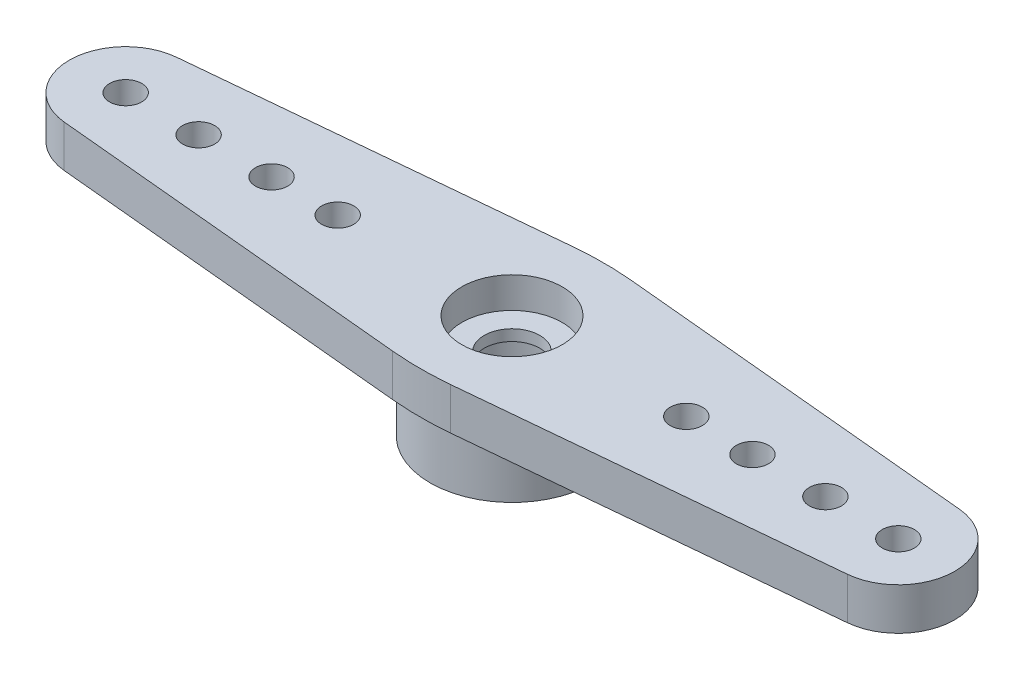
ISO-10303-21;
HEADER;
FILE_DESCRIPTION(('STEP AP214'),'2;1');
FILE_NAME('part.step','',(''),(''),'','','');
FILE_SCHEMA(('AUTOMOTIVE_DESIGN { 1 0 10303 214 1 1 1 1 }'));
ENDSEC;
DATA;
#1=APPLICATION_CONTEXT('core data for automotive mechanical design processes');
#2=APPLICATION_PROTOCOL_DEFINITION('international standard','automotive_design',2000,#1);
#3=PRODUCT_CONTEXT('',#1,'mechanical');
#4=PRODUCT('Part','Part','',(#3));
#5=PRODUCT_RELATED_PRODUCT_CATEGORY('part','',(#4));
#6=PRODUCT_DEFINITION_FORMATION('','',#4);
#7=PRODUCT_DEFINITION_CONTEXT('part definition',#1,'design');
#8=PRODUCT_DEFINITION('design','',#6,#7);
#9=PRODUCT_DEFINITION_SHAPE('','',#8);
#10=(LENGTH_UNIT() NAMED_UNIT(*) SI_UNIT(.MILLI.,.METRE.));
#11=(NAMED_UNIT(*) PLANE_ANGLE_UNIT() SI_UNIT($,.RADIAN.));
#12=(NAMED_UNIT(*) SI_UNIT($,.STERADIAN.) SOLID_ANGLE_UNIT());
#13=UNCERTAINTY_MEASURE_WITH_UNIT(LENGTH_MEASURE(1.E-05),#10,'distance_accuracy_value','');
#14=(GEOMETRIC_REPRESENTATION_CONTEXT(3) GLOBAL_UNCERTAINTY_ASSIGNED_CONTEXT((#13)) GLOBAL_UNIT_ASSIGNED_CONTEXT((#10,
#11,#12)) REPRESENTATION_CONTEXT('',''));
#15=CARTESIAN_POINT('',(0.,0.,0.));
#16=DIRECTION('',(0.,0.,1.));
#17=DIRECTION('',(1.,0.,0.));
#18=AXIS2_PLACEMENT_3D('',#15,#16,#17);
#19=CARTESIAN_POINT('',(0.,4.2672,0.));
#20=DIRECTION('',(0.,-1.,0.));
#21=DIRECTION('',(0.,0.,-1.));
#22=AXIS2_PLACEMENT_3D('',#19,#20,#21);
#23=CYLINDRICAL_SURFACE('',#22,1.143);
#24=CARTESIAN_POINT('',(0.,2.54,0.));
#25=DIRECTION('',(0.,1.,0.));
#26=DIRECTION('',(0.,0.,1.));
#27=AXIS2_PLACEMENT_3D('',#24,#25,#26);
#28=CIRCLE('',#27,1.143);
#29=CARTESIAN_POINT('',(0.,2.54,1.143));
#30=VERTEX_POINT('',#29);
#31=EDGE_CURVE('E196',#30,#30,#28,.T.);
#32=ORIENTED_EDGE('',*,*,#31,.F.);
#33=EDGE_LOOP('',(#32));
#34=FACE_BOUND('',#33,.T.);
#35=CARTESIAN_POINT('',(0.,2.9972,0.));
#36=DIRECTION('',(0.,1.,0.));
#37=DIRECTION('',(0.,0.,1.));
#38=AXIS2_PLACEMENT_3D('',#35,#36,#37);
#39=CIRCLE('',#38,1.143);
#40=CARTESIAN_POINT('',(0.,2.9972,1.143));
#41=VERTEX_POINT('',#40);
#42=EDGE_CURVE('E356',#41,#41,#39,.F.);
#43=ORIENTED_EDGE('',*,*,#42,.F.);
#44=EDGE_LOOP('',(#43));
#45=FACE_BOUND('',#44,.T.);
#46=ADVANCED_FACE('F34',(#34,#45),#23,.F.);
#47=CARTESIAN_POINT('',(0.,0.,0.));
#48=DIRECTION('',(0.,1.,0.));
#49=DIRECTION('',(0.,0.,1.));
#50=AXIS2_PLACEMENT_3D('',#47,#48,#49);
#51=PLANE('',#50);
#52=CARTESIAN_POINT('',(0.,0.,0.));
#53=DIRECTION('',(0.,1.,0.));
#54=DIRECTION('',(0.,0.,1.));
#55=AXIS2_PLACEMENT_3D('',#52,#53,#54);
#56=CIRCLE('',#55,3.3655);
#57=CARTESIAN_POINT('',(0.,0.,3.3655));
#58=VERTEX_POINT('',#57);
#59=EDGE_CURVE('E210',#58,#58,#56,.T.);
#60=ORIENTED_EDGE('',*,*,#59,.F.);
#61=EDGE_LOOP('',(#60));
#62=FACE_BOUND('',#61,.T.);
#63=CARTESIAN_POINT('',(0.,0.,0.));
#64=DIRECTION('',(0.,1.,0.));
#65=DIRECTION('',(0.,0.,1.));
#66=AXIS2_PLACEMENT_3D('',#63,#64,#65);
#67=CIRCLE('',#66,2.2352);
#68=CARTESIAN_POINT('',(0.,0.,2.2352));
#69=VERTEX_POINT('',#68);
#70=EDGE_CURVE('E207',#69,#69,#67,.T.);
#71=ORIENTED_EDGE('',*,*,#70,.T.);
#72=EDGE_LOOP('',(#71));
#73=FACE_BOUND('',#72,.T.);
#74=ADVANCED_FACE('F257',(#62,#73),#51,.F.);
#75=CARTESIAN_POINT('',(0.,2.54,0.));
#76=DIRECTION('',(0.,-1.,0.));
#77=DIRECTION('',(0.,0.,-1.));
#78=AXIS2_PLACEMENT_3D('',#75,#76,#77);
#79=CYLINDRICAL_SURFACE('',#78,3.3655);
#80=CARTESIAN_POINT('',(0.,2.54,0.));
#81=DIRECTION('',(0.,1.,0.));
#82=DIRECTION('',(0.,0.,1.));
#83=AXIS2_PLACEMENT_3D('',#80,#81,#82);
#84=CIRCLE('',#83,3.3655);
#85=CARTESIAN_POINT('',(0.,2.54,3.3655));
#86=VERTEX_POINT('',#85);
#87=EDGE_CURVE('E211',#86,#86,#84,.T.);
#88=ORIENTED_EDGE('',*,*,#87,.F.);
#89=EDGE_LOOP('',(#88));
#90=FACE_BOUND('',#89,.T.);
#91=ORIENTED_EDGE('',*,*,#59,.T.);
#92=EDGE_LOOP('',(#91));
#93=FACE_BOUND('',#92,.T.);
#94=ADVANCED_FACE('F263',(#90,#93),#79,.T.);
#95=CARTESIAN_POINT('',(0.,2.54,0.));
#96=DIRECTION('',(0.,-1.,0.));
#97=DIRECTION('',(0.,0.,-1.));
#98=AXIS2_PLACEMENT_3D('',#95,#96,#97);
#99=CYLINDRICAL_SURFACE('',#98,2.2352);
#100=CARTESIAN_POINT('',(0.,2.54,0.));
#101=DIRECTION('',(0.,1.,0.));
#102=DIRECTION('',(0.,0.,1.));
#103=AXIS2_PLACEMENT_3D('',#100,#101,#102);
#104=CIRCLE('',#103,2.2352);
#105=CARTESIAN_POINT('',(0.,2.54,2.2352));
#106=VERTEX_POINT('',#105);
#107=EDGE_CURVE('E119',#106,#106,#104,.T.);
#108=ORIENTED_EDGE('',*,*,#107,.T.);
#109=EDGE_LOOP('',(#108));
#110=FACE_BOUND('',#109,.T.);
#111=ORIENTED_EDGE('',*,*,#70,.F.);
#112=EDGE_LOOP('',(#111));
#113=FACE_BOUND('',#112,.T.);
#114=ADVANCED_FACE('F316',(#110,#113),#99,.F.);
#115=CARTESIAN_POINT('',(-29.0607200096115,2.54,0.));
#116=DIRECTION('',(0.,1.,0.));
#117=DIRECTION('',(0.,0.,1.));
#118=AXIS2_PLACEMENT_3D('',#115,#116,#117);
#119=PLANE('',#118);
#120=CARTESIAN_POINT('',(-9.8806,2.54,0.));
#121=DIRECTION('',(0.,1.,0.));
#122=DIRECTION('',(0.,0.,1.));
#123=AXIS2_PLACEMENT_3D('',#120,#121,#122);
#124=CIRCLE('',#123,0.6604);
#125=CARTESIAN_POINT('',(-9.8806,2.54,0.6604));
#126=VERTEX_POINT('',#125);
#127=EDGE_CURVE('E159',#126,#126,#124,.F.);
#128=ORIENTED_EDGE('',*,*,#127,.F.);
#129=EDGE_LOOP('',(#128));
#130=FACE_BOUND('',#129,.T.);
#131=DIRECTION('',(-0.995596740434201,0.,0.0937396950965555));
#132=VECTOR('',#131,1.);
#133=CARTESIAN_POINT('',(-29.162120546294,2.54,-1.07696151236052));
#134=LINE('',#133,#132);
#135=CARTESIAN_POINT('',(-1.19049412772623,2.54,-3.71060988156648));
#136=VERTEX_POINT('',#135);
#137=CARTESIAN_POINT('',(-16.09226517831,2.54,-2.30754434514137));
#138=VERTEX_POINT('',#137);
#139=EDGE_CURVE('E115',#136,#138,#134,.T.);
#140=ORIENTED_EDGE('',*,*,#139,.F.);
#141=CARTESIAN_POINT('',(0.,2.54,8.93346872194787));
#142=DIRECTION('',(0.,1.,0.));
#143=DIRECTION('',(0.,0.,1.));
#144=AXIS2_PLACEMENT_3D('',#141,#142,#143);
#145=CIRCLE('',#144,12.7);
#146=CARTESIAN_POINT('',(1.19049412772628,2.54,-3.71060988156648));
#147=VERTEX_POINT('',#146);
#148=EDGE_CURVE('E220',#136,#147,#145,.F.);
#149=ORIENTED_EDGE('',*,*,#148,.T.);
#150=DIRECTION('',(0.995596740434201,0.,0.0937396950965555));
#151=VECTOR('',#150,1.);
#152=CARTESIAN_POINT('',(-28.4485987983057,2.54,-6.50125736059801));
#153=LINE('',#152,#151);
#154=CARTESIAN_POINT('',(16.09226517831,2.54,-2.30754434514137));
#155=VERTEX_POINT('',#154);
#156=EDGE_CURVE('E173',#147,#155,#153,.T.);
#157=ORIENTED_EDGE('',*,*,#156,.T.);
#158=CARTESIAN_POINT('',(15.875,2.54,0.));
#159=DIRECTION('',(0.,1.,0.));
#160=DIRECTION('',(0.,0.,1.));
#161=AXIS2_PLACEMENT_3D('',#158,#159,#160);
#162=CIRCLE('',#161,2.31775);
#163=CARTESIAN_POINT('',(16.09226517831,2.54,2.30754434514137));
#164=VERTEX_POINT('',#163);
#165=EDGE_CURVE('E170',#164,#155,#162,.T.);
#166=ORIENTED_EDGE('',*,*,#165,.F.);
#167=DIRECTION('',(0.995596740434201,0.,-0.0937396950965555));
#168=VECTOR('',#167,1.);
#169=CARTESIAN_POINT('',(-28.4485987983057,2.54,6.50125736059801));
#170=LINE('',#169,#168);
#171=CARTESIAN_POINT('',(1.19049412772627,2.54,3.71060988156648));
#172=VERTEX_POINT('',#171);
#173=EDGE_CURVE('E168',#172,#164,#170,.T.);
#174=ORIENTED_EDGE('',*,*,#173,.F.);
#175=CARTESIAN_POINT('',(0.,2.54,-8.93346872194787));
#176=DIRECTION('',(0.,1.,0.));
#177=DIRECTION('',(0.,0.,1.));
#178=AXIS2_PLACEMENT_3D('',#175,#176,#177);
#179=CIRCLE('',#178,12.7);
#180=CARTESIAN_POINT('',(-1.19049412772624,2.54,3.71060988156648));
#181=VERTEX_POINT('',#180);
#182=EDGE_CURVE('E218',#172,#181,#179,.F.);
#183=ORIENTED_EDGE('',*,*,#182,.T.);
#184=DIRECTION('',(-0.995596740434201,0.,-0.0937396950965555));
#185=VECTOR('',#184,1.);
#186=CARTESIAN_POINT('',(-29.162120546294,2.54,1.07696151236052));
#187=LINE('',#186,#185);
#188=CARTESIAN_POINT('',(-16.09226517831,2.54,2.30754434514137));
#189=VERTEX_POINT('',#188);
#190=EDGE_CURVE('E166',#181,#189,#187,.T.);
#191=ORIENTED_EDGE('',*,*,#190,.T.);
#192=CARTESIAN_POINT('',(-15.875,2.54,0.));
#193=DIRECTION('',(0.,1.,0.));
#194=DIRECTION('',(0.,0.,1.));
#195=AXIS2_PLACEMENT_3D('',#192,#193,#194);
#196=CIRCLE('',#195,2.31775);
#197=EDGE_CURVE('E164',#189,#138,#196,.F.);
#198=ORIENTED_EDGE('',*,*,#197,.T.);
#199=EDGE_LOOP('',(#140,#149,#157,#166,#174,#183,#191,#198));
#200=FACE_BOUND('',#199,.T.);
#201=CARTESIAN_POINT('',(-7.1628,2.54,0.));
#202=DIRECTION('',(0.,1.,0.));
#203=DIRECTION('',(0.,0.,1.));
#204=AXIS2_PLACEMENT_3D('',#201,#202,#203);
#205=CIRCLE('',#204,0.6604);
#206=CARTESIAN_POINT('',(-7.1628,2.54,0.6604));
#207=VERTEX_POINT('',#206);
#208=EDGE_CURVE('E175',#207,#207,#205,.F.);
#209=ORIENTED_EDGE('',*,*,#208,.F.);
#210=EDGE_LOOP('',(#209));
#211=FACE_BOUND('',#210,.T.);
#212=CARTESIAN_POINT('',(-12.8778,2.54,0.));
#213=DIRECTION('',(0.,1.,0.));
#214=DIRECTION('',(0.,0.,1.));
#215=AXIS2_PLACEMENT_3D('',#212,#213,#214);
#216=CIRCLE('',#215,0.660399999999998);
#217=CARTESIAN_POINT('',(-12.8778,2.54,0.660399999999998));
#218=VERTEX_POINT('',#217);
#219=EDGE_CURVE('E178',#218,#218,#216,.F.);
#220=ORIENTED_EDGE('',*,*,#219,.F.);
#221=EDGE_LOOP('',(#220));
#222=FACE_BOUND('',#221,.T.);
#223=CARTESIAN_POINT('',(-15.875,2.54,0.));
#224=DIRECTION('',(0.,1.,0.));
#225=DIRECTION('',(0.,0.,1.));
#226=AXIS2_PLACEMENT_3D('',#223,#224,#225);
#227=CIRCLE('',#226,0.660399999999998);
#228=CARTESIAN_POINT('',(-15.875,2.54,0.660399999999998));
#229=VERTEX_POINT('',#228);
#230=EDGE_CURVE('E181',#229,#229,#227,.F.);
#231=ORIENTED_EDGE('',*,*,#230,.F.);
#232=EDGE_LOOP('',(#231));
#233=FACE_BOUND('',#232,.T.);
#234=CARTESIAN_POINT('',(12.8778,2.54,0.));
#235=DIRECTION('',(0.,1.,0.));
#236=DIRECTION('',(0.,0.,1.));
#237=AXIS2_PLACEMENT_3D('',#234,#235,#236);
#238=CIRCLE('',#237,0.660399999999998);
#239=CARTESIAN_POINT('',(12.8778,2.54,0.660399999999998));
#240=VERTEX_POINT('',#239);
#241=EDGE_CURVE('E184',#240,#240,#238,.T.);
#242=ORIENTED_EDGE('',*,*,#241,.T.);
#243=EDGE_LOOP('',(#242));
#244=FACE_BOUND('',#243,.T.);
#245=CARTESIAN_POINT('',(9.8806,2.54,0.));
#246=DIRECTION('',(0.,1.,0.));
#247=DIRECTION('',(0.,0.,1.));
#248=AXIS2_PLACEMENT_3D('',#245,#246,#247);
#249=CIRCLE('',#248,0.6604);
#250=CARTESIAN_POINT('',(9.8806,2.54,0.6604));
#251=VERTEX_POINT('',#250);
#252=EDGE_CURVE('E187',#251,#251,#249,.T.);
#253=ORIENTED_EDGE('',*,*,#252,.T.);
#254=EDGE_LOOP('',(#253));
#255=FACE_BOUND('',#254,.T.);
#256=CARTESIAN_POINT('',(7.1628,2.54,0.));
#257=DIRECTION('',(0.,1.,0.));
#258=DIRECTION('',(0.,0.,1.));
#259=AXIS2_PLACEMENT_3D('',#256,#257,#258);
#260=CIRCLE('',#259,0.6604);
#261=CARTESIAN_POINT('',(7.1628,2.54,0.6604));
#262=VERTEX_POINT('',#261);
#263=EDGE_CURVE('E190',#262,#262,#260,.T.);
#264=ORIENTED_EDGE('',*,*,#263,.T.);
#265=EDGE_LOOP('',(#264));
#266=FACE_BOUND('',#265,.T.);
#267=CARTESIAN_POINT('',(15.875,2.54,0.));
#268=DIRECTION('',(0.,1.,0.));
#269=DIRECTION('',(0.,0.,1.));
#270=AXIS2_PLACEMENT_3D('',#267,#268,#269);
#271=CIRCLE('',#270,0.660399999999998);
#272=CARTESIAN_POINT('',(15.875,2.54,0.660399999999998));
#273=VERTEX_POINT('',#272);
#274=EDGE_CURVE('E193',#273,#273,#271,.T.);
#275=ORIENTED_EDGE('',*,*,#274,.T.);
#276=EDGE_LOOP('',(#275));
#277=FACE_BOUND('',#276,.T.);
#278=ORIENTED_EDGE('',*,*,#87,.T.);
#279=EDGE_LOOP('',(#278));
#280=FACE_BOUND('',#279,.T.);
#281=ADVANCED_FACE('F234',(#130,#200,#211,#222,#233,#244,#255,#266,#277,#280),#119,.F.);
#282=CARTESIAN_POINT('',(-29.162120546294,4.2672,-1.07696151236052));
#283=DIRECTION('',(0.0937396950965555,0.,0.995596740434201));
#284=DIRECTION('',(0.995596740434201,0.,-0.0937396950965555));
#285=AXIS2_PLACEMENT_3D('',#282,#283,#284);
#286=PLANE('',#285);
#287=DIRECTION('',(-0.995596740434201,0.,0.0937396950965555));
#288=VECTOR('',#287,1.);
#289=CARTESIAN_POINT('',(-29.162120546294,4.2672,-1.07696151236052));
#290=LINE('',#289,#288);
#291=CARTESIAN_POINT('',(-1.19049412772623,4.2672,-3.71060988156648));
#292=VERTEX_POINT('',#291);
#293=CARTESIAN_POINT('',(-16.09226517831,4.2672,-2.30754434514137));
#294=VERTEX_POINT('',#293);
#295=EDGE_CURVE('E97',#292,#294,#290,.T.);
#296=ORIENTED_EDGE('',*,*,#295,.F.);
#297=DIRECTION('',(0.,-1.,0.));
#298=VECTOR('',#297,1.);
#299=CARTESIAN_POINT('',(-1.19049412772624,2.54,-3.71060988156648));
#300=LINE('',#299,#298);
#301=EDGE_CURVE('E214',#292,#136,#300,.T.);
#302=ORIENTED_EDGE('',*,*,#301,.T.);
#303=ORIENTED_EDGE('',*,*,#139,.T.);
#304=DIRECTION('',(0.,-1.,0.));
#305=VECTOR('',#304,1.);
#306=CARTESIAN_POINT('',(-16.09226517831,4.2672,-2.30754434514137));
#307=LINE('',#306,#305);
#308=EDGE_CURVE('E112',#294,#138,#307,.T.);
#309=ORIENTED_EDGE('',*,*,#308,.F.);
#310=EDGE_LOOP('',(#296,#302,#303,#309));
#311=FACE_BOUND('',#310,.T.);
#312=ADVANCED_FACE('F113',(#311),#286,.F.);
#313=CARTESIAN_POINT('',(-15.875,4.2672,0.));
#314=DIRECTION('',(0.,-1.,0.));
#315=DIRECTION('',(0.,0.,-1.));
#316=AXIS2_PLACEMENT_3D('',#313,#314,#315);
#317=CYLINDRICAL_SURFACE('',#316,2.31775);
#318=ORIENTED_EDGE('',*,*,#197,.F.);
#319=DIRECTION('',(0.,-1.,0.));
#320=VECTOR('',#319,1.);
#321=CARTESIAN_POINT('',(-16.09226517831,4.2672,2.30754434514137));
#322=LINE('',#321,#320);
#323=CARTESIAN_POINT('',(-16.09226517831,4.2672,2.30754434514137));
#324=VERTEX_POINT('',#323);
#325=EDGE_CURVE('E120',#324,#189,#322,.T.);
#326=ORIENTED_EDGE('',*,*,#325,.F.);
#327=CARTESIAN_POINT('',(-15.875,4.2672,0.));
#328=DIRECTION('',(0.,1.,0.));
#329=DIRECTION('',(0.,0.,1.));
#330=AXIS2_PLACEMENT_3D('',#327,#328,#329);
#331=CIRCLE('',#330,2.31775);
#332=EDGE_CURVE('E103',#324,#294,#331,.F.);
#333=ORIENTED_EDGE('',*,*,#332,.T.);
#334=ORIENTED_EDGE('',*,*,#308,.T.);
#335=EDGE_LOOP('',(#318,#326,#333,#334));
#336=FACE_BOUND('',#335,.T.);
#337=ADVANCED_FACE('F123',(#336),#317,.T.);
#338=CARTESIAN_POINT('',(-29.162120546294,4.2672,1.07696151236052));
#339=DIRECTION('',(-0.0937396950965555,0.,0.995596740434201));
#340=DIRECTION('',(0.995596740434201,0.,0.0937396950965555));
#341=AXIS2_PLACEMENT_3D('',#338,#339,#340);
#342=PLANE('',#341);
#343=ORIENTED_EDGE('',*,*,#190,.F.);
#344=DIRECTION('',(0.,-1.,0.));
#345=VECTOR('',#344,1.);
#346=CARTESIAN_POINT('',(-1.19049412772625,4.2672,3.71060988156648));
#347=LINE('',#346,#345);
#348=CARTESIAN_POINT('',(-1.19049412772624,4.2672,3.71060988156648));
#349=VERTEX_POINT('',#348);
#350=EDGE_CURVE('E11',#181,#349,#347,.F.);
#351=ORIENTED_EDGE('',*,*,#350,.T.);
#352=DIRECTION('',(-0.995596740434201,0.,-0.0937396950965555));
#353=VECTOR('',#352,1.);
#354=CARTESIAN_POINT('',(-29.162120546294,4.2672,1.07696151236052));
#355=LINE('',#354,#353);
#356=EDGE_CURVE('E125',#349,#324,#355,.T.);
#357=ORIENTED_EDGE('',*,*,#356,.T.);
#358=ORIENTED_EDGE('',*,*,#325,.T.);
#359=EDGE_LOOP('',(#343,#351,#357,#358));
#360=FACE_BOUND('',#359,.T.);
#361=ADVANCED_FACE('F245',(#360),#342,.T.);
#362=CARTESIAN_POINT('',(-28.4485987983057,4.2672,6.50125736059801));
#363=DIRECTION('',(-0.0937396950965555,0.,-0.995596740434201));
#364=DIRECTION('',(-0.995596740434201,0.,0.0937396950965555));
#365=AXIS2_PLACEMENT_3D('',#362,#363,#364);
#366=PLANE('',#365);
#367=DIRECTION('',(0.995596740434201,0.,-0.0937396950965555));
#368=VECTOR('',#367,1.);
#369=CARTESIAN_POINT('',(-28.4485987983057,4.2672,6.50125736059801));
#370=LINE('',#369,#368);
#371=CARTESIAN_POINT('',(1.19049412772627,4.2672,3.71060988156648));
#372=VERTEX_POINT('',#371);
#373=CARTESIAN_POINT('',(16.09226517831,4.2672,2.30754434514137));
#374=VERTEX_POINT('',#373);
#375=EDGE_CURVE('E127',#372,#374,#370,.T.);
#376=ORIENTED_EDGE('',*,*,#375,.F.);
#377=DIRECTION('',(0.,-1.,0.));
#378=VECTOR('',#377,1.);
#379=CARTESIAN_POINT('',(1.19049412772626,2.54,3.71060988156648));
#380=LINE('',#379,#378);
#381=EDGE_CURVE('E42',#372,#172,#380,.T.);
#382=ORIENTED_EDGE('',*,*,#381,.T.);
#383=ORIENTED_EDGE('',*,*,#173,.T.);
#384=DIRECTION('',(0.,-1.,0.));
#385=VECTOR('',#384,1.);
#386=CARTESIAN_POINT('',(16.09226517831,4.2672,2.30754434514137));
#387=LINE('',#386,#385);
#388=EDGE_CURVE('E201',#374,#164,#387,.T.);
#389=ORIENTED_EDGE('',*,*,#388,.F.);
#390=EDGE_LOOP('',(#376,#382,#383,#389));
#391=FACE_BOUND('',#390,.T.);
#392=ADVANCED_FACE('F229',(#391),#366,.F.);
#393=CARTESIAN_POINT('',(15.875,4.2672,0.));
#394=DIRECTION('',(0.,-1.,0.));
#395=DIRECTION('',(0.,0.,-1.));
#396=AXIS2_PLACEMENT_3D('',#393,#394,#395);
#397=CYLINDRICAL_SURFACE('',#396,2.31775);
#398=ORIENTED_EDGE('',*,*,#165,.T.);
#399=DIRECTION('',(0.,-1.,0.));
#400=VECTOR('',#399,1.);
#401=CARTESIAN_POINT('',(16.09226517831,4.2672,-2.30754434514137));
#402=LINE('',#401,#400);
#403=CARTESIAN_POINT('',(16.09226517831,4.2672,-2.30754434514137));
#404=VERTEX_POINT('',#403);
#405=EDGE_CURVE('E158',#404,#155,#402,.T.);
#406=ORIENTED_EDGE('',*,*,#405,.F.);
#407=CARTESIAN_POINT('',(15.875,4.2672,0.));
#408=DIRECTION('',(0.,1.,0.));
#409=DIRECTION('',(0.,0.,1.));
#410=AXIS2_PLACEMENT_3D('',#407,#408,#409);
#411=CIRCLE('',#410,2.31775);
#412=EDGE_CURVE('E132',#374,#404,#411,.T.);
#413=ORIENTED_EDGE('',*,*,#412,.F.);
#414=ORIENTED_EDGE('',*,*,#388,.T.);
#415=EDGE_LOOP('',(#398,#406,#413,#414));
#416=FACE_BOUND('',#415,.T.);
#417=ADVANCED_FACE('F239',(#416),#397,.T.);
#418=CARTESIAN_POINT('',(15.875,4.2672,0.));
#419=DIRECTION('',(0.,-1.,0.));
#420=DIRECTION('',(0.,0.,-1.));
#421=AXIS2_PLACEMENT_3D('',#418,#419,#420);
#422=CYLINDRICAL_SURFACE('',#421,0.660399999999998);
#423=CARTESIAN_POINT('',(15.875,4.2672,0.));
#424=DIRECTION('',(0.,1.,0.));
#425=DIRECTION('',(0.,0.,1.));
#426=AXIS2_PLACEMENT_3D('',#423,#424,#425);
#427=CIRCLE('',#426,0.660399999999998);
#428=CARTESIAN_POINT('',(15.875,4.2672,0.660399999999998));
#429=VERTEX_POINT('',#428);
#430=EDGE_CURVE('E155',#429,#429,#427,.T.);
#431=ORIENTED_EDGE('',*,*,#430,.T.);
#432=EDGE_LOOP('',(#431));
#433=FACE_BOUND('',#432,.T.);
#434=ORIENTED_EDGE('',*,*,#274,.F.);
#435=EDGE_LOOP('',(#434));
#436=FACE_BOUND('',#435,.T.);
#437=ADVANCED_FACE('F271',(#433,#436),#422,.F.);
#438=CARTESIAN_POINT('',(7.1628,4.2672,0.));
#439=DIRECTION('',(0.,-1.,0.));
#440=DIRECTION('',(0.,0.,-1.));
#441=AXIS2_PLACEMENT_3D('',#438,#439,#440);
#442=CYLINDRICAL_SURFACE('',#441,0.6604);
#443=CARTESIAN_POINT('',(7.1628,4.2672,0.));
#444=DIRECTION('',(0.,1.,0.));
#445=DIRECTION('',(0.,0.,1.));
#446=AXIS2_PLACEMENT_3D('',#443,#444,#445);
#447=CIRCLE('',#446,0.6604);
#448=CARTESIAN_POINT('',(7.1628,4.2672,0.6604));
#449=VERTEX_POINT('',#448);
#450=EDGE_CURVE('E152',#449,#449,#447,.T.);
#451=ORIENTED_EDGE('',*,*,#450,.T.);
#452=EDGE_LOOP('',(#451));
#453=FACE_BOUND('',#452,.T.);
#454=ORIENTED_EDGE('',*,*,#263,.F.);
#455=EDGE_LOOP('',(#454));
#456=FACE_BOUND('',#455,.T.);
#457=ADVANCED_FACE('F274',(#453,#456),#442,.F.);
#458=CARTESIAN_POINT('',(9.8806,4.2672,0.));
#459=DIRECTION('',(0.,-1.,0.));
#460=DIRECTION('',(0.,0.,-1.));
#461=AXIS2_PLACEMENT_3D('',#458,#459,#460);
#462=CYLINDRICAL_SURFACE('',#461,0.6604);
#463=CARTESIAN_POINT('',(9.8806,4.2672,0.));
#464=DIRECTION('',(0.,1.,0.));
#465=DIRECTION('',(0.,0.,1.));
#466=AXIS2_PLACEMENT_3D('',#463,#464,#465);
#467=CIRCLE('',#466,0.6604);
#468=CARTESIAN_POINT('',(9.8806,4.2672,0.6604));
#469=VERTEX_POINT('',#468);
#470=EDGE_CURVE('E149',#469,#469,#467,.T.);
#471=ORIENTED_EDGE('',*,*,#470,.T.);
#472=EDGE_LOOP('',(#471));
#473=FACE_BOUND('',#472,.T.);
#474=ORIENTED_EDGE('',*,*,#252,.F.);
#475=EDGE_LOOP('',(#474));
#476=FACE_BOUND('',#475,.T.);
#477=ADVANCED_FACE('F278',(#473,#476),#462,.F.);
#478=CARTESIAN_POINT('',(12.8778,4.2672,0.));
#479=DIRECTION('',(0.,-1.,0.));
#480=DIRECTION('',(0.,0.,-1.));
#481=AXIS2_PLACEMENT_3D('',#478,#479,#480);
#482=CYLINDRICAL_SURFACE('',#481,0.660399999999998);
#483=CARTESIAN_POINT('',(12.8778,4.2672,0.));
#484=DIRECTION('',(0.,1.,0.));
#485=DIRECTION('',(0.,0.,1.));
#486=AXIS2_PLACEMENT_3D('',#483,#484,#485);
#487=CIRCLE('',#486,0.660399999999998);
#488=CARTESIAN_POINT('',(12.8778,4.2672,0.660399999999998));
#489=VERTEX_POINT('',#488);
#490=EDGE_CURVE('E146',#489,#489,#487,.T.);
#491=ORIENTED_EDGE('',*,*,#490,.T.);
#492=EDGE_LOOP('',(#491));
#493=FACE_BOUND('',#492,.T.);
#494=ORIENTED_EDGE('',*,*,#241,.F.);
#495=EDGE_LOOP('',(#494));
#496=FACE_BOUND('',#495,.T.);
#497=ADVANCED_FACE('F282',(#493,#496),#482,.F.);
#498=CARTESIAN_POINT('',(-15.875,4.2672,0.));
#499=DIRECTION('',(0.,-1.,0.));
#500=DIRECTION('',(0.,0.,-1.));
#501=AXIS2_PLACEMENT_3D('',#498,#499,#500);
#502=CYLINDRICAL_SURFACE('',#501,0.660399999999998);
#503=CARTESIAN_POINT('',(-15.875,4.2672,0.));
#504=DIRECTION('',(0.,1.,0.));
#505=DIRECTION('',(0.,0.,1.));
#506=AXIS2_PLACEMENT_3D('',#503,#504,#505);
#507=CIRCLE('',#506,0.660399999999998);
#508=CARTESIAN_POINT('',(-15.875,4.2672,0.660399999999998));
#509=VERTEX_POINT('',#508);
#510=EDGE_CURVE('E143',#509,#509,#507,.F.);
#511=ORIENTED_EDGE('',*,*,#510,.F.);
#512=EDGE_LOOP('',(#511));
#513=FACE_BOUND('',#512,.T.);
#514=ORIENTED_EDGE('',*,*,#230,.T.);
#515=EDGE_LOOP('',(#514));
#516=FACE_BOUND('',#515,.T.);
#517=ADVANCED_FACE('F286',(#513,#516),#502,.F.);
#518=CARTESIAN_POINT('',(-12.8778,4.2672,0.));
#519=DIRECTION('',(0.,-1.,0.));
#520=DIRECTION('',(0.,0.,-1.));
#521=AXIS2_PLACEMENT_3D('',#518,#519,#520);
#522=CYLINDRICAL_SURFACE('',#521,0.660399999999998);
#523=CARTESIAN_POINT('',(-12.8778,4.2672,0.));
#524=DIRECTION('',(0.,1.,0.));
#525=DIRECTION('',(0.,0.,1.));
#526=AXIS2_PLACEMENT_3D('',#523,#524,#525);
#527=CIRCLE('',#526,0.660399999999998);
#528=CARTESIAN_POINT('',(-12.8778,4.2672,0.660399999999998));
#529=VERTEX_POINT('',#528);
#530=EDGE_CURVE('E140',#529,#529,#527,.F.);
#531=ORIENTED_EDGE('',*,*,#530,.F.);
#532=EDGE_LOOP('',(#531));
#533=FACE_BOUND('',#532,.T.);
#534=ORIENTED_EDGE('',*,*,#219,.T.);
#535=EDGE_LOOP('',(#534));
#536=FACE_BOUND('',#535,.T.);
#537=ADVANCED_FACE('F290',(#533,#536),#522,.F.);
#538=CARTESIAN_POINT('',(-7.1628,4.2672,0.));
#539=DIRECTION('',(0.,-1.,0.));
#540=DIRECTION('',(0.,0.,-1.));
#541=AXIS2_PLACEMENT_3D('',#538,#539,#540);
#542=CYLINDRICAL_SURFACE('',#541,0.6604);
#543=CARTESIAN_POINT('',(-7.1628,4.2672,0.));
#544=DIRECTION('',(0.,1.,0.));
#545=DIRECTION('',(0.,0.,1.));
#546=AXIS2_PLACEMENT_3D('',#543,#544,#545);
#547=CIRCLE('',#546,0.6604);
#548=CARTESIAN_POINT('',(-7.1628,4.2672,0.6604));
#549=VERTEX_POINT('',#548);
#550=EDGE_CURVE('E137',#549,#549,#547,.F.);
#551=ORIENTED_EDGE('',*,*,#550,.F.);
#552=EDGE_LOOP('',(#551));
#553=FACE_BOUND('',#552,.T.);
#554=ORIENTED_EDGE('',*,*,#208,.T.);
#555=EDGE_LOOP('',(#554));
#556=FACE_BOUND('',#555,.T.);
#557=ADVANCED_FACE('F294',(#553,#556),#542,.F.);
#558=CARTESIAN_POINT('',(-28.4485987983057,4.2672,-6.50125736059801));
#559=DIRECTION('',(0.0937396950965555,0.,-0.995596740434201));
#560=DIRECTION('',(-0.995596740434201,0.,-0.0937396950965555));
#561=AXIS2_PLACEMENT_3D('',#558,#559,#560);
#562=PLANE('',#561);
#563=ORIENTED_EDGE('',*,*,#156,.F.);
#564=DIRECTION('',(0.,-1.,0.));
#565=VECTOR('',#564,1.);
#566=CARTESIAN_POINT('',(1.19049412772627,4.2672,-3.71060988156648));
#567=LINE('',#566,#565);
#568=CARTESIAN_POINT('',(1.19049412772628,4.2672,-3.71060988156648));
#569=VERTEX_POINT('',#568);
#570=EDGE_CURVE('E222',#147,#569,#567,.F.);
#571=ORIENTED_EDGE('',*,*,#570,.T.);
#572=DIRECTION('',(0.995596740434201,0.,0.0937396950965555));
#573=VECTOR('',#572,1.);
#574=CARTESIAN_POINT('',(-28.4485987983057,4.2672,-6.50125736059801));
#575=LINE('',#574,#573);
#576=EDGE_CURVE('E135',#569,#404,#575,.T.);
#577=ORIENTED_EDGE('',*,*,#576,.T.);
#578=ORIENTED_EDGE('',*,*,#405,.T.);
#579=EDGE_LOOP('',(#563,#571,#577,#578));
#580=FACE_BOUND('',#579,.T.);
#581=ADVANCED_FACE('F298',(#580),#562,.T.);
#582=CARTESIAN_POINT('',(-9.8806,4.2672,0.));
#583=DIRECTION('',(0.,-1.,0.));
#584=DIRECTION('',(0.,0.,-1.));
#585=AXIS2_PLACEMENT_3D('',#582,#583,#584);
#586=CYLINDRICAL_SURFACE('',#585,0.6604);
#587=CARTESIAN_POINT('',(-9.8806,4.2672,0.));
#588=DIRECTION('',(0.,1.,0.));
#589=DIRECTION('',(0.,0.,1.));
#590=AXIS2_PLACEMENT_3D('',#587,#588,#589);
#591=CIRCLE('',#590,0.6604);
#592=CARTESIAN_POINT('',(-9.8806,4.2672,0.6604));
#593=VERTEX_POINT('',#592);
#594=EDGE_CURVE('E109',#593,#593,#591,.F.);
#595=ORIENTED_EDGE('',*,*,#594,.F.);
#596=EDGE_LOOP('',(#595));
#597=FACE_BOUND('',#596,.T.);
#598=ORIENTED_EDGE('',*,*,#127,.T.);
#599=EDGE_LOOP('',(#598));
#600=FACE_BOUND('',#599,.T.);
#601=ADVANCED_FACE('F302',(#597,#600),#586,.F.);
#602=CARTESIAN_POINT('',(-29.0607200096115,4.2672,0.));
#603=DIRECTION('',(0.,1.,0.));
#604=DIRECTION('',(0.,0.,1.));
#605=AXIS2_PLACEMENT_3D('',#602,#603,#604);
#606=PLANE('',#605);
#607=CARTESIAN_POINT('',(0.,4.2672,0.));
#608=DIRECTION('',(0.,1.,0.));
#609=DIRECTION('',(0.,0.,1.));
#610=AXIS2_PLACEMENT_3D('',#607,#608,#609);
#611=CIRCLE('',#610,2.06375);
#612=CARTESIAN_POINT('',(0.,4.2672,2.06375));
#613=VERTEX_POINT('',#612);
#614=EDGE_CURVE('E360',#613,#613,#611,.T.);
#615=ORIENTED_EDGE('',*,*,#614,.F.);
#616=EDGE_LOOP('',(#615));
#617=FACE_BOUND('',#616,.T.);
#618=ORIENTED_EDGE('',*,*,#594,.T.);
#619=EDGE_LOOP('',(#618));
#620=FACE_BOUND('',#619,.T.);
#621=ORIENTED_EDGE('',*,*,#576,.F.);
#622=CARTESIAN_POINT('',(0.,4.2672,8.93346872194787));
#623=DIRECTION('',(0.,1.,0.));
#624=DIRECTION('',(0.,0.,1.));
#625=AXIS2_PLACEMENT_3D('',#622,#623,#624);
#626=CIRCLE('',#625,12.7);
#627=EDGE_CURVE('E105',#569,#292,#626,.T.);
#628=ORIENTED_EDGE('',*,*,#627,.T.);
#629=ORIENTED_EDGE('',*,*,#295,.T.);
#630=ORIENTED_EDGE('',*,*,#332,.F.);
#631=ORIENTED_EDGE('',*,*,#356,.F.);
#632=CARTESIAN_POINT('',(0.,4.2672,-8.93346872194787));
#633=DIRECTION('',(0.,1.,0.));
#634=DIRECTION('',(0.,0.,1.));
#635=AXIS2_PLACEMENT_3D('',#632,#633,#634);
#636=CIRCLE('',#635,12.7);
#637=EDGE_CURVE('E49',#349,#372,#636,.T.);
#638=ORIENTED_EDGE('',*,*,#637,.T.);
#639=ORIENTED_EDGE('',*,*,#375,.T.);
#640=ORIENTED_EDGE('',*,*,#412,.T.);
#641=EDGE_LOOP('',(#621,#628,#629,#630,#631,#638,#639,#640));
#642=FACE_BOUND('',#641,.T.);
#643=ORIENTED_EDGE('',*,*,#550,.T.);
#644=EDGE_LOOP('',(#643));
#645=FACE_BOUND('',#644,.T.);
#646=ORIENTED_EDGE('',*,*,#530,.T.);
#647=EDGE_LOOP('',(#646));
#648=FACE_BOUND('',#647,.T.);
#649=ORIENTED_EDGE('',*,*,#510,.T.);
#650=EDGE_LOOP('',(#649));
#651=FACE_BOUND('',#650,.T.);
#652=ORIENTED_EDGE('',*,*,#490,.F.);
#653=EDGE_LOOP('',(#652));
#654=FACE_BOUND('',#653,.T.);
#655=ORIENTED_EDGE('',*,*,#470,.F.);
#656=EDGE_LOOP('',(#655));
#657=FACE_BOUND('',#656,.T.);
#658=ORIENTED_EDGE('',*,*,#450,.F.);
#659=EDGE_LOOP('',(#658));
#660=FACE_BOUND('',#659,.T.);
#661=ORIENTED_EDGE('',*,*,#430,.F.);
#662=EDGE_LOOP('',(#661));
#663=FACE_BOUND('',#662,.T.);
#664=ADVANCED_FACE('F100',(#617,#620,#642,#645,#648,#651,#654,#657,#660,#663),#606,.T.);
#665=ORIENTED_EDGE('',*,*,#107,.F.);
#666=EDGE_LOOP('',(#665));
#667=FACE_BOUND('',#666,.T.);
#668=ORIENTED_EDGE('',*,*,#31,.T.);
#669=EDGE_LOOP('',(#668));
#670=FACE_BOUND('',#669,.T.);
#671=ADVANCED_FACE('F255',(#667,#670),#119,.F.);
#672=CARTESIAN_POINT('',(0.,4.2672,8.93346872194787));
#673=DIRECTION('',(0.,1.,0.));
#674=DIRECTION('',(0.,0.,1.));
#675=AXIS2_PLACEMENT_3D('',#672,#673,#674);
#676=CYLINDRICAL_SURFACE('',#675,12.7);
#677=ORIENTED_EDGE('',*,*,#627,.F.);
#678=ORIENTED_EDGE('',*,*,#570,.F.);
#679=ORIENTED_EDGE('',*,*,#148,.F.);
#680=ORIENTED_EDGE('',*,*,#301,.F.);
#681=EDGE_LOOP('',(#677,#678,#679,#680));
#682=FACE_BOUND('',#681,.T.);
#683=ADVANCED_FACE('F244',(#682),#676,.T.);
#684=CARTESIAN_POINT('',(0.,4.2672,-8.93346872194787));
#685=DIRECTION('',(0.,1.,0.));
#686=DIRECTION('',(0.,0.,1.));
#687=AXIS2_PLACEMENT_3D('',#684,#685,#686);
#688=CYLINDRICAL_SURFACE('',#687,12.7);
#689=ORIENTED_EDGE('',*,*,#637,.F.);
#690=ORIENTED_EDGE('',*,*,#350,.F.);
#691=ORIENTED_EDGE('',*,*,#182,.F.);
#692=ORIENTED_EDGE('',*,*,#381,.F.);
#693=EDGE_LOOP('',(#689,#690,#691,#692));
#694=FACE_BOUND('',#693,.T.);
#695=ADVANCED_FACE('F36',(#694),#688,.T.);
#696=CARTESIAN_POINT('',(0.,2.9972,0.));
#697=DIRECTION('',(0.,1.,0.));
#698=DIRECTION('',(0.,0.,1.));
#699=AXIS2_PLACEMENT_3D('',#696,#697,#698);
#700=CYLINDRICAL_SURFACE('',#699,2.06375);
#701=CARTESIAN_POINT('',(0.,2.9972,0.));
#702=DIRECTION('',(0.,1.,0.));
#703=DIRECTION('',(0.,0.,1.));
#704=AXIS2_PLACEMENT_3D('',#701,#702,#703);
#705=CIRCLE('',#704,2.06375);
#706=CARTESIAN_POINT('',(0.,2.9972,2.06375));
#707=VERTEX_POINT('',#706);
#708=EDGE_CURVE('E162',#707,#707,#705,.T.);
#709=ORIENTED_EDGE('',*,*,#708,.F.);
#710=EDGE_LOOP('',(#709));
#711=FACE_BOUND('',#710,.T.);
#712=ORIENTED_EDGE('',*,*,#614,.T.);
#713=EDGE_LOOP('',(#712));
#714=FACE_BOUND('',#713,.T.);
#715=ADVANCED_FACE('F247',(#711,#714),#700,.F.);
#716=CARTESIAN_POINT('',(-28.8343368229583,2.9972,0.729493466455382));
#717=DIRECTION('',(0.,1.,0.));
#718=DIRECTION('',(0.,0.,1.));
#719=AXIS2_PLACEMENT_3D('',#716,#717,#718);
#720=PLANE('',#719);
#721=ORIENTED_EDGE('',*,*,#42,.T.);
#722=EDGE_LOOP('',(#721));
#723=FACE_BOUND('',#722,.T.);
#724=ORIENTED_EDGE('',*,*,#708,.T.);
#725=EDGE_LOOP('',(#724));
#726=FACE_BOUND('',#725,.T.);
#727=ADVANCED_FACE('F252',(#723,#726),#720,.T.);
#728=CLOSED_SHELL('',(#46,#74,#94,#114,#281,#312,#337,#361,#392,#417,#437,#457,#477,#497,#517,
#537,#557,#581,#601,#664,#671,#683,#695,#715,#727));
#729=MANIFOLD_SOLID_BREP('B2',#728);
#730=ADVANCED_BREP_SHAPE_REPRESENTATION('',(#18,#729),#14);
#731=SHAPE_DEFINITION_REPRESENTATION(#9,#730);
ENDSEC;
END-ISO-10303-21;
